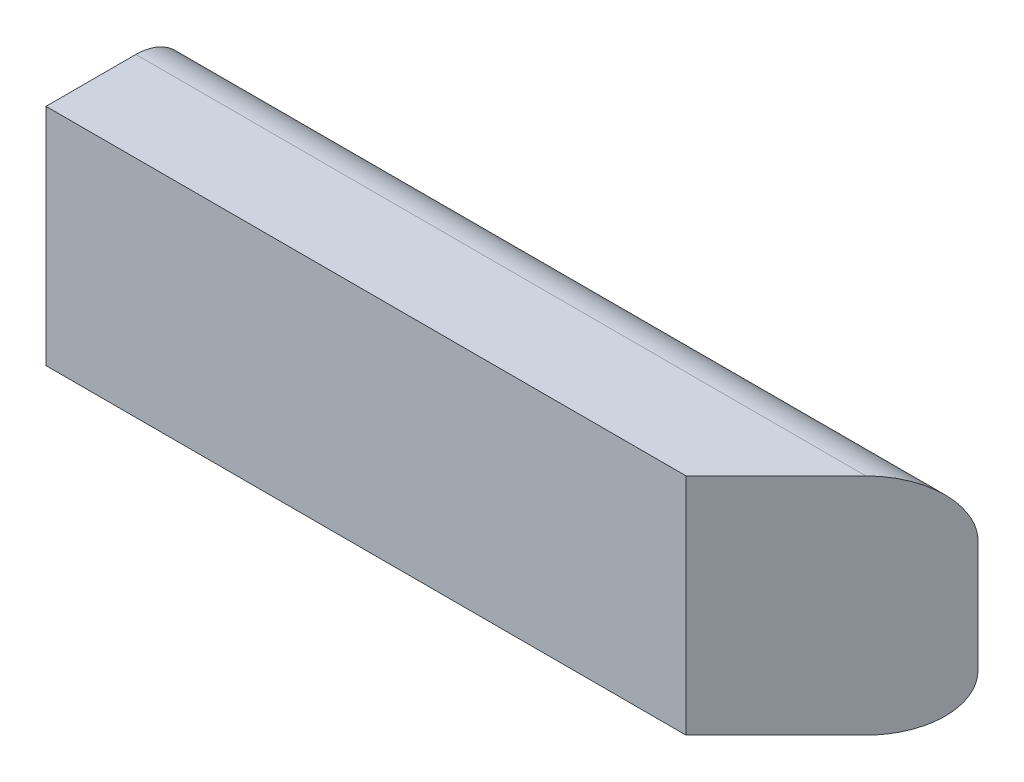
ISO-10303-21;
HEADER;
FILE_DESCRIPTION(('STEP AP214'),'2;1');
FILE_NAME('part.step','',(''),(''),'','','');
FILE_SCHEMA(('AUTOMOTIVE_DESIGN { 1 0 10303 214 1 1 1 1 }'));
ENDSEC;
DATA;
#1=APPLICATION_CONTEXT('core data for automotive mechanical design processes');
#2=APPLICATION_PROTOCOL_DEFINITION('international standard','automotive_design',2000,#1);
#3=PRODUCT_CONTEXT('',#1,'mechanical');
#4=PRODUCT('Part','Part','',(#3));
#5=PRODUCT_RELATED_PRODUCT_CATEGORY('part','',(#4));
#6=PRODUCT_DEFINITION_FORMATION('','',#4);
#7=PRODUCT_DEFINITION_CONTEXT('part definition',#1,'design');
#8=PRODUCT_DEFINITION('design','',#6,#7);
#9=PRODUCT_DEFINITION_SHAPE('','',#8);
#10=(LENGTH_UNIT() NAMED_UNIT(*) SI_UNIT(.MILLI.,.METRE.));
#11=(NAMED_UNIT(*) PLANE_ANGLE_UNIT() SI_UNIT($,.RADIAN.));
#12=(NAMED_UNIT(*) SI_UNIT($,.STERADIAN.) SOLID_ANGLE_UNIT());
#13=UNCERTAINTY_MEASURE_WITH_UNIT(LENGTH_MEASURE(1.E-05),#10,'distance_accuracy_value','');
#14=(GEOMETRIC_REPRESENTATION_CONTEXT(3) GLOBAL_UNCERTAINTY_ASSIGNED_CONTEXT((#13)) GLOBAL_UNIT_ASSIGNED_CONTEXT((#10,
#11,#12)) REPRESENTATION_CONTEXT('',''));
#15=CARTESIAN_POINT('',(0.,0.,0.));
#16=DIRECTION('',(0.,0.,1.));
#17=DIRECTION('',(1.,0.,0.));
#18=AXIS2_PLACEMENT_3D('',#15,#16,#17);
#19=CARTESIAN_POINT('',(444.5,0.,0.));
#20=DIRECTION('',(0.,1.,0.));
#21=DIRECTION('',(0.,0.,1.));
#22=AXIS2_PLACEMENT_3D('',#19,#20,#21);
#23=PLANE('',#22);
#24=DIRECTION('',(-1.,0.,0.));
#25=VECTOR('',#24,1.);
#26=CARTESIAN_POINT('',(444.5,0.,-31.75));
#27=LINE('',#26,#25);
#28=CARTESIAN_POINT('',(412.75,0.,-31.75));
#29=VERTEX_POINT('',#28);
#30=CARTESIAN_POINT('',(0.,0.,-31.75));
#31=VERTEX_POINT('',#30);
#32=EDGE_CURVE('E11',#29,#31,#27,.T.);
#33=ORIENTED_EDGE('',*,*,#32,.F.);
#34=DIRECTION('',(-0.707106781186549,0.,0.707106781186546));
#35=VECTOR('',#34,1.);
#36=CARTESIAN_POINT('',(412.75,0.,-31.7500000000001));
#37=LINE('',#36,#35);
#38=CARTESIAN_POINT('',(361.95,0.,19.05));
#39=VERTEX_POINT('',#38);
#40=EDGE_CURVE('E146',#29,#39,#37,.T.);
#41=ORIENTED_EDGE('',*,*,#40,.T.);
#42=DIRECTION('',(-1.,0.,0.));
#43=VECTOR('',#42,1.);
#44=CARTESIAN_POINT('',(444.5,0.,19.05));
#45=LINE('',#44,#43);
#46=CARTESIAN_POINT('',(0.,0.,19.05));
#47=VERTEX_POINT('',#46);
#48=EDGE_CURVE('E96',#39,#47,#45,.T.);
#49=ORIENTED_EDGE('',*,*,#48,.T.);
#50=DIRECTION('',(0.,0.,-1.));
#51=VECTOR('',#50,1.);
#52=CARTESIAN_POINT('',(0.,0.,0.));
#53=LINE('',#52,#51);
#54=EDGE_CURVE('E112',#47,#31,#53,.T.);
#55=ORIENTED_EDGE('',*,*,#54,.T.);
#56=EDGE_LOOP('',(#33,#41,#49,#55));
#57=FACE_BOUND('',#56,.T.);
#58=ADVANCED_FACE('F39',(#57),#23,.F.);
#59=CARTESIAN_POINT('',(444.5,31.75,-31.75));
#60=DIRECTION('',(-1.,0.,0.));
#61=DIRECTION('',(0.,0.,1.));
#62=AXIS2_PLACEMENT_3D('',#59,#60,#61);
#63=CYLINDRICAL_SURFACE('',#62,31.75);
#64=DIRECTION('',(-1.,0.,0.));
#65=VECTOR('',#64,1.);
#66=CARTESIAN_POINT('',(444.5,31.75,-63.5));
#67=LINE('',#66,#65);
#68=CARTESIAN_POINT('',(444.5,31.75,-63.5));
#69=VERTEX_POINT('',#68);
#70=CARTESIAN_POINT('',(0.,31.75,-63.5));
#71=VERTEX_POINT('',#70);
#72=EDGE_CURVE('E48',#69,#71,#67,.T.);
#73=ORIENTED_EDGE('',*,*,#72,.F.);
#74=CARTESIAN_POINT('',(412.75,31.75,-31.75));
#75=DIRECTION('',(-0.707106781186546,0.,-0.707106781186549));
#76=DIRECTION('',(-0.707106781186549,0.,0.707106781186546));
#77=AXIS2_PLACEMENT_3D('',#74,#75,#76);
#78=ELLIPSE('',#77,44.9012806053458,31.75);
#79=EDGE_CURVE('E58',#69,#29,#78,.T.);
#80=ORIENTED_EDGE('',*,*,#79,.T.);
#81=ORIENTED_EDGE('',*,*,#32,.T.);
#82=CARTESIAN_POINT('',(0.,31.75,-31.75));
#83=DIRECTION('',(1.,0.,0.));
#84=DIRECTION('',(0.,0.,-1.));
#85=AXIS2_PLACEMENT_3D('',#82,#83,#84);
#86=CIRCLE('',#85,31.75);
#87=EDGE_CURVE('E137',#31,#71,#86,.T.);
#88=ORIENTED_EDGE('',*,*,#87,.T.);
#89=EDGE_LOOP('',(#73,#80,#81,#88));
#90=FACE_BOUND('',#89,.T.);
#91=ADVANCED_FACE('F173',(#90),#63,.T.);
#92=CARTESIAN_POINT('',(444.5,95.25,-63.5));
#93=DIRECTION('',(0.,0.,1.));
#94=DIRECTION('',(1.,0.,0.));
#95=AXIS2_PLACEMENT_3D('',#92,#93,#94);
#96=PLANE('',#95);
#97=DIRECTION('',(0.,1.,0.));
#98=VECTOR('',#97,1.);
#99=CARTESIAN_POINT('',(0.,95.25,-63.5));
#100=LINE('',#99,#98);
#101=CARTESIAN_POINT('',(0.,95.25,-63.5));
#102=VERTEX_POINT('',#101);
#103=EDGE_CURVE('E135',#71,#102,#100,.T.);
#104=ORIENTED_EDGE('',*,*,#103,.T.);
#105=DIRECTION('',(-1.,0.,0.));
#106=VECTOR('',#105,1.);
#107=CARTESIAN_POINT('',(444.5,95.25,-63.5));
#108=LINE('',#107,#106);
#109=CARTESIAN_POINT('',(444.5,95.25,-63.5));
#110=VERTEX_POINT('',#109);
#111=EDGE_CURVE('E123',#110,#102,#108,.T.);
#112=ORIENTED_EDGE('',*,*,#111,.F.);
#113=DIRECTION('',(0.,1.,0.));
#114=VECTOR('',#113,1.);
#115=CARTESIAN_POINT('',(444.5,95.25,-63.5));
#116=LINE('',#115,#114);
#117=EDGE_CURVE('E113',#69,#110,#116,.T.);
#118=ORIENTED_EDGE('',*,*,#117,.F.);
#119=ORIENTED_EDGE('',*,*,#72,.T.);
#120=EDGE_LOOP('',(#104,#112,#118,#119));
#121=FACE_BOUND('',#120,.T.);
#122=ADVANCED_FACE('F133',(#121),#96,.F.);
#123=CARTESIAN_POINT('',(444.5,95.25,-31.75));
#124=DIRECTION('',(-1.,0.,0.));
#125=DIRECTION('',(0.,0.,1.));
#126=AXIS2_PLACEMENT_3D('',#123,#124,#125);
#127=CYLINDRICAL_SURFACE('',#126,31.75);
#128=DIRECTION('',(-1.,0.,0.));
#129=VECTOR('',#128,1.);
#130=CARTESIAN_POINT('',(444.5,127.,-31.75));
#131=LINE('',#130,#129);
#132=CARTESIAN_POINT('',(412.75,127.,-31.75));
#133=VERTEX_POINT('',#132);
#134=CARTESIAN_POINT('',(0.,127.,-31.75));
#135=VERTEX_POINT('',#134);
#136=EDGE_CURVE('E95',#133,#135,#131,.T.);
#137=ORIENTED_EDGE('',*,*,#136,.F.);
#138=CARTESIAN_POINT('',(412.75,95.25,-31.75));
#139=DIRECTION('',(-0.707106781186546,0.,-0.707106781186549));
#140=DIRECTION('',(-0.707106781186549,0.,0.707106781186546));
#141=AXIS2_PLACEMENT_3D('',#138,#139,#140);
#142=ELLIPSE('',#141,44.9012806053458,31.75);
#143=EDGE_CURVE('E154',#133,#110,#142,.T.);
#144=ORIENTED_EDGE('',*,*,#143,.T.);
#145=ORIENTED_EDGE('',*,*,#111,.T.);
#146=CARTESIAN_POINT('',(0.,95.25,-31.75));
#147=DIRECTION('',(1.,0.,0.));
#148=DIRECTION('',(0.,0.,-1.));
#149=AXIS2_PLACEMENT_3D('',#146,#147,#148);
#150=CIRCLE('',#149,31.75);
#151=EDGE_CURVE('E106',#102,#135,#150,.T.);
#152=ORIENTED_EDGE('',*,*,#151,.T.);
#153=EDGE_LOOP('',(#137,#144,#145,#152));
#154=FACE_BOUND('',#153,.T.);
#155=ADVANCED_FACE('F160',(#154),#127,.T.);
#156=CARTESIAN_POINT('',(444.5,127.,19.05));
#157=DIRECTION('',(0.,-1.,0.));
#158=DIRECTION('',(0.,0.,-1.));
#159=AXIS2_PLACEMENT_3D('',#156,#157,#158);
#160=PLANE('',#159);
#161=DIRECTION('',(-1.,0.,0.));
#162=VECTOR('',#161,1.);
#163=CARTESIAN_POINT('',(444.5,127.,19.05));
#164=LINE('',#163,#162);
#165=CARTESIAN_POINT('',(361.95,127.,19.05));
#166=VERTEX_POINT('',#165);
#167=CARTESIAN_POINT('',(0.,127.,19.05));
#168=VERTEX_POINT('',#167);
#169=EDGE_CURVE('E83',#166,#168,#164,.T.);
#170=ORIENTED_EDGE('',*,*,#169,.F.);
#171=DIRECTION('',(0.707106781186549,0.,-0.707106781186546));
#172=VECTOR('',#171,1.);
#173=CARTESIAN_POINT('',(403.225,127.,-22.2250000000001));
#174=LINE('',#173,#172);
#175=EDGE_CURVE('E151',#166,#133,#174,.T.);
#176=ORIENTED_EDGE('',*,*,#175,.T.);
#177=ORIENTED_EDGE('',*,*,#136,.T.);
#178=DIRECTION('',(0.,0.,1.));
#179=VECTOR('',#178,1.);
#180=CARTESIAN_POINT('',(0.,127.,19.05));
#181=LINE('',#180,#179);
#182=EDGE_CURVE('E99',#135,#168,#181,.T.);
#183=ORIENTED_EDGE('',*,*,#182,.T.);
#184=EDGE_LOOP('',(#170,#176,#177,#183));
#185=FACE_BOUND('',#184,.T.);
#186=ADVANCED_FACE('F100',(#185),#160,.F.);
#187=CARTESIAN_POINT('',(444.5,0.,19.05));
#188=DIRECTION('',(0.,0.,-1.));
#189=DIRECTION('',(-1.,0.,0.));
#190=AXIS2_PLACEMENT_3D('',#187,#188,#189);
#191=PLANE('',#190);
#192=ORIENTED_EDGE('',*,*,#48,.F.);
#193=DIRECTION('',(0.,1.,0.));
#194=VECTOR('',#193,1.);
#195=CARTESIAN_POINT('',(361.95,0.,19.05));
#196=LINE('',#195,#194);
#197=EDGE_CURVE('E91',#39,#166,#196,.T.);
#198=ORIENTED_EDGE('',*,*,#197,.T.);
#199=ORIENTED_EDGE('',*,*,#169,.T.);
#200=DIRECTION('',(0.,-1.,0.));
#201=VECTOR('',#200,1.);
#202=CARTESIAN_POINT('',(0.,0.,19.05));
#203=LINE('',#202,#201);
#204=EDGE_CURVE('E88',#168,#47,#203,.T.);
#205=ORIENTED_EDGE('',*,*,#204,.T.);
#206=EDGE_LOOP('',(#192,#198,#199,#205));
#207=FACE_BOUND('',#206,.T.);
#208=ADVANCED_FACE('F86',(#207),#191,.F.);
#209=CARTESIAN_POINT('',(0.,95.25,-31.75));
#210=DIRECTION('',(1.,0.,0.));
#211=DIRECTION('',(0.,0.,-1.));
#212=AXIS2_PLACEMENT_3D('',#209,#210,#211);
#213=PLANE('',#212);
#214=ORIENTED_EDGE('',*,*,#54,.F.);
#215=ORIENTED_EDGE('',*,*,#204,.F.);
#216=ORIENTED_EDGE('',*,*,#182,.F.);
#217=ORIENTED_EDGE('',*,*,#151,.F.);
#218=ORIENTED_EDGE('',*,*,#103,.F.);
#219=ORIENTED_EDGE('',*,*,#87,.F.);
#220=EDGE_LOOP('',(#214,#215,#216,#217,#218,#219));
#221=FACE_BOUND('',#220,.T.);
#222=ADVANCED_FACE('F109',(#221),#213,.F.);
#223=CARTESIAN_POINT('',(190.499999999999,0.,190.5));
#224=DIRECTION('',(-0.707106781186546,0.,-0.707106781186549));
#225=DIRECTION('',(-0.707106781186549,0.,0.707106781186546));
#226=AXIS2_PLACEMENT_3D('',#223,#224,#225);
#227=PLANE('',#226);
#228=ORIENTED_EDGE('',*,*,#117,.T.);
#229=ORIENTED_EDGE('',*,*,#143,.F.);
#230=ORIENTED_EDGE('',*,*,#175,.F.);
#231=ORIENTED_EDGE('',*,*,#197,.F.);
#232=ORIENTED_EDGE('',*,*,#40,.F.);
#233=ORIENTED_EDGE('',*,*,#79,.F.);
#234=EDGE_LOOP('',(#228,#229,#230,#231,#232,#233));
#235=FACE_BOUND('',#234,.T.);
#236=ADVANCED_FACE('F165',(#235),#227,.F.);
#237=CLOSED_SHELL('',(#58,#91,#122,#155,#186,#208,#222,#236));
#238=MANIFOLD_SOLID_BREP('B2',#237);
#239=ADVANCED_BREP_SHAPE_REPRESENTATION('',(#18,#238),#14);
#240=SHAPE_DEFINITION_REPRESENTATION(#9,#239);
ENDSEC;
END-ISO-10303-21;
